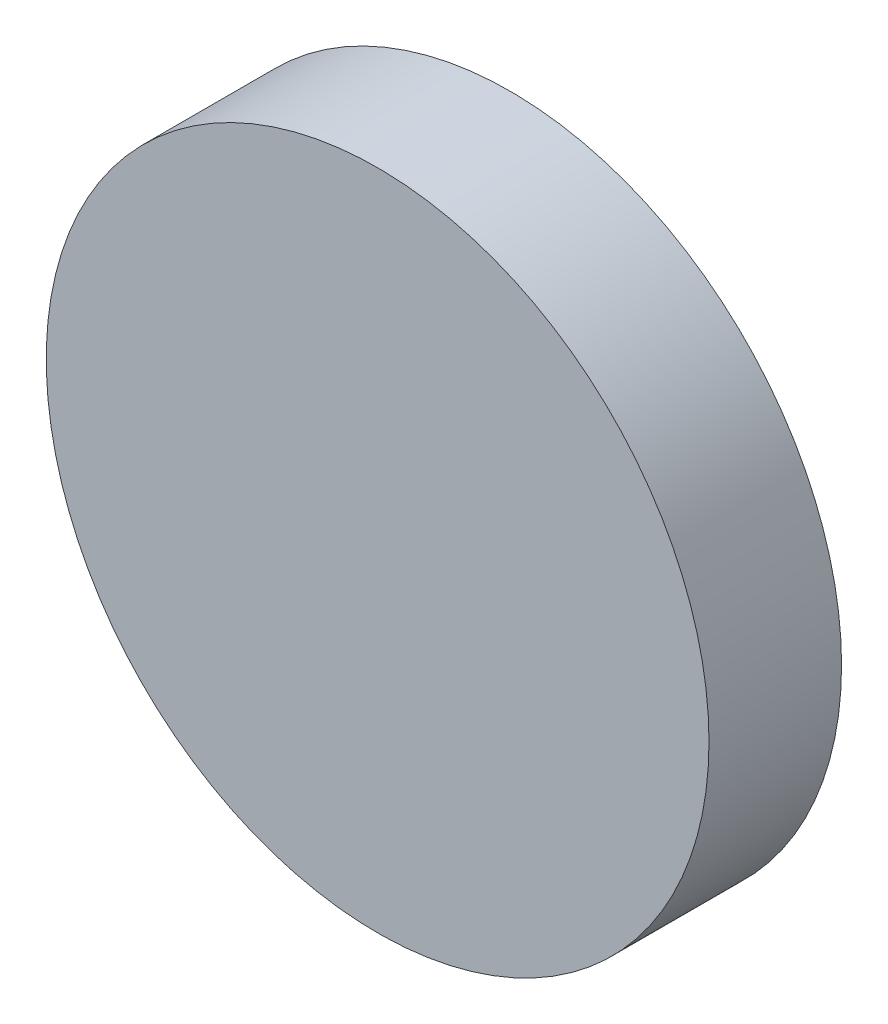
ISO-10303-21;
HEADER;
FILE_DESCRIPTION(('STEP AP214'),'2;1');
FILE_NAME('part.step','',(''),(''),'','','');
FILE_SCHEMA(('AUTOMOTIVE_DESIGN { 1 0 10303 214 1 1 1 1 }'));
ENDSEC;
DATA;
#1=APPLICATION_CONTEXT('core data for automotive mechanical design processes');
#2=APPLICATION_PROTOCOL_DEFINITION('international standard','automotive_design',2000,#1);
#3=PRODUCT_CONTEXT('',#1,'mechanical');
#4=PRODUCT('Part','Part','',(#3));
#5=PRODUCT_RELATED_PRODUCT_CATEGORY('part','',(#4));
#6=PRODUCT_DEFINITION_FORMATION('','',#4);
#7=PRODUCT_DEFINITION_CONTEXT('part definition',#1,'design');
#8=PRODUCT_DEFINITION('design','',#6,#7);
#9=PRODUCT_DEFINITION_SHAPE('','',#8);
#10=(LENGTH_UNIT() NAMED_UNIT(*) SI_UNIT(.MILLI.,.METRE.));
#11=(NAMED_UNIT(*) PLANE_ANGLE_UNIT() SI_UNIT($,.RADIAN.));
#12=(NAMED_UNIT(*) SI_UNIT($,.STERADIAN.) SOLID_ANGLE_UNIT());
#13=UNCERTAINTY_MEASURE_WITH_UNIT(LENGTH_MEASURE(1.E-05),#10,'distance_accuracy_value','');
#14=(GEOMETRIC_REPRESENTATION_CONTEXT(3) GLOBAL_UNCERTAINTY_ASSIGNED_CONTEXT((#13)) GLOBAL_UNIT_ASSIGNED_CONTEXT((#10,
#11,#12)) REPRESENTATION_CONTEXT('',''));
#15=CARTESIAN_POINT('',(0.,0.,0.));
#16=DIRECTION('',(0.,0.,1.));
#17=DIRECTION('',(1.,0.,0.));
#18=AXIS2_PLACEMENT_3D('',#15,#16,#17);
#19=CARTESIAN_POINT('',(0.,0.,2.));
#20=DIRECTION('',(0.,0.,-1.));
#21=DIRECTION('',(-1.,0.,0.));
#22=AXIS2_PLACEMENT_3D('',#19,#20,#21);
#23=CYLINDRICAL_SURFACE('',#22,5.);
#24=CARTESIAN_POINT('',(0.,0.,2.));
#25=DIRECTION('',(0.,0.,1.));
#26=DIRECTION('',(1.,0.,0.));
#27=AXIS2_PLACEMENT_3D('',#24,#25,#26);
#28=CIRCLE('',#27,5.);
#29=CARTESIAN_POINT('',(5.,0.,2.));
#30=VERTEX_POINT('',#29);
#31=EDGE_CURVE('E10',#30,#30,#28,.T.);
#32=ORIENTED_EDGE('',*,*,#31,.F.);
#33=EDGE_LOOP('',(#32));
#34=FACE_BOUND('',#33,.T.);
#35=CARTESIAN_POINT('',(0.,0.,0.));
#36=DIRECTION('',(0.,0.,1.));
#37=DIRECTION('',(1.,0.,0.));
#38=AXIS2_PLACEMENT_3D('',#35,#36,#37);
#39=CIRCLE('',#38,5.);
#40=CARTESIAN_POINT('',(5.,0.,0.));
#41=VERTEX_POINT('',#40);
#42=EDGE_CURVE('E38',#41,#41,#39,.T.);
#43=ORIENTED_EDGE('',*,*,#42,.T.);
#44=EDGE_LOOP('',(#43));
#45=FACE_BOUND('',#44,.T.);
#46=ADVANCED_FACE('F35',(#34,#45),#23,.T.);
#47=CARTESIAN_POINT('',(0.,0.,2.));
#48=DIRECTION('',(0.,0.,1.));
#49=DIRECTION('',(1.,0.,0.));
#50=AXIS2_PLACEMENT_3D('',#47,#48,#49);
#51=PLANE('',#50);
#52=ORIENTED_EDGE('',*,*,#31,.T.);
#53=EDGE_LOOP('',(#52));
#54=FACE_BOUND('',#53,.T.);
#55=ADVANCED_FACE('F50',(#54),#51,.T.);
#56=CARTESIAN_POINT('',(0.,0.,0.));
#57=DIRECTION('',(0.,0.,1.));
#58=DIRECTION('',(1.,0.,0.));
#59=AXIS2_PLACEMENT_3D('',#56,#57,#58);
#60=PLANE('',#59);
#61=ORIENTED_EDGE('',*,*,#42,.F.);
#62=EDGE_LOOP('',(#61));
#63=FACE_BOUND('',#62,.T.);
#64=ADVANCED_FACE('F48',(#63),#60,.F.);
#65=CLOSED_SHELL('',(#46,#55,#64));
#66=MANIFOLD_SOLID_BREP('B2',#65);
#67=ADVANCED_BREP_SHAPE_REPRESENTATION('',(#18,#66),#14);
#68=SHAPE_DEFINITION_REPRESENTATION(#9,#67);
ENDSEC;
END-ISO-10303-21;
